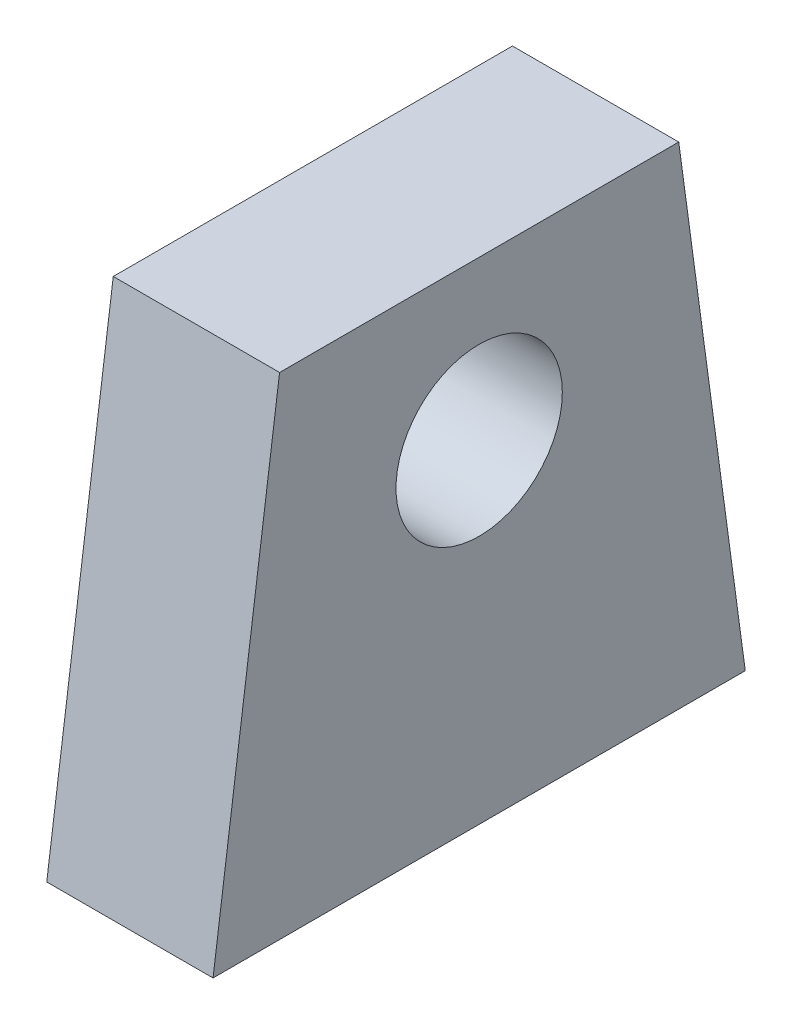
ISO-10303-21;
HEADER;
FILE_DESCRIPTION(('STEP AP214'),'2;1');
FILE_NAME('part.step','',(''),(''),'','','');
FILE_SCHEMA(('AUTOMOTIVE_DESIGN { 1 0 10303 214 1 1 1 1 }'));
ENDSEC;
DATA;
#1=APPLICATION_CONTEXT('core data for automotive mechanical design processes');
#2=APPLICATION_PROTOCOL_DEFINITION('international standard','automotive_design',2000,#1);
#3=PRODUCT_CONTEXT('',#1,'mechanical');
#4=PRODUCT('Part','Part','',(#3));
#5=PRODUCT_RELATED_PRODUCT_CATEGORY('part','',(#4));
#6=PRODUCT_DEFINITION_FORMATION('','',#4);
#7=PRODUCT_DEFINITION_CONTEXT('part definition',#1,'design');
#8=PRODUCT_DEFINITION('design','',#6,#7);
#9=PRODUCT_DEFINITION_SHAPE('','',#8);
#10=(LENGTH_UNIT() NAMED_UNIT(*) SI_UNIT(.MILLI.,.METRE.));
#11=(NAMED_UNIT(*) PLANE_ANGLE_UNIT() SI_UNIT($,.RADIAN.));
#12=(NAMED_UNIT(*) SI_UNIT($,.STERADIAN.) SOLID_ANGLE_UNIT());
#13=UNCERTAINTY_MEASURE_WITH_UNIT(LENGTH_MEASURE(1.E-05),#10,'distance_accuracy_value','');
#14=(GEOMETRIC_REPRESENTATION_CONTEXT(3) GLOBAL_UNCERTAINTY_ASSIGNED_CONTEXT((#13)) GLOBAL_UNIT_ASSIGNED_CONTEXT((#10,
#11,#12)) REPRESENTATION_CONTEXT('',''));
#15=CARTESIAN_POINT('',(0.,0.,0.));
#16=DIRECTION('',(0.,0.,1.));
#17=DIRECTION('',(1.,0.,0.));
#18=AXIS2_PLACEMENT_3D('',#15,#16,#17);
#19=CARTESIAN_POINT('',(5.,0.,0.));
#20=DIRECTION('',(-1.,0.,0.));
#21=DIRECTION('',(0.,0.,1.));
#22=AXIS2_PLACEMENT_3D('',#19,#20,#21);
#23=PLANE('',#22);
#24=DIRECTION('',(0.,0.990950558720919,-0.134227382343165));
#25=VECTOR('',#24,1.);
#26=CARTESIAN_POINT('',(5.,-10.,8.));
#27=LINE('',#26,#25);
#28=CARTESIAN_POINT('',(5.,-10.,8.));
#29=VERTEX_POINT('',#28);
#30=CARTESIAN_POINT('',(5.,4.76525193924236,6.));
#31=VERTEX_POINT('',#30);
#32=EDGE_CURVE('E107',#29,#31,#27,.T.);
#33=ORIENTED_EDGE('',*,*,#32,.F.);
#34=DIRECTION('',(0.,0.,1.));
#35=VECTOR('',#34,1.);
#36=CARTESIAN_POINT('',(5.,-10.,-8.));
#37=LINE('',#36,#35);
#38=CARTESIAN_POINT('',(5.,-10.,-8.));
#39=VERTEX_POINT('',#38);
#40=EDGE_CURVE('E100',#39,#29,#37,.T.);
#41=ORIENTED_EDGE('',*,*,#40,.F.);
#42=DIRECTION('',(0.,0.990950558720919,0.134227382343165));
#43=VECTOR('',#42,1.);
#44=CARTESIAN_POINT('',(5.,-10.,-8.));
#45=LINE('',#44,#43);
#46=CARTESIAN_POINT('',(5.,4.76525193924236,-6.));
#47=VERTEX_POINT('',#46);
#48=EDGE_CURVE('E96',#39,#47,#45,.T.);
#49=ORIENTED_EDGE('',*,*,#48,.T.);
#50=DIRECTION('',(0.,0.,-1.));
#51=VECTOR('',#50,1.);
#52=CARTESIAN_POINT('',(5.,4.76525193924236,6.));
#53=LINE('',#52,#51);
#54=EDGE_CURVE('E99',#31,#47,#53,.T.);
#55=ORIENTED_EDGE('',*,*,#54,.F.);
#56=EDGE_LOOP('',(#33,#41,#49,#55));
#57=FACE_BOUND('',#56,.T.);
#58=CARTESIAN_POINT('',(5.,0.,0.));
#59=DIRECTION('',(1.,0.,0.));
#60=DIRECTION('',(0.,0.,-1.));
#61=AXIS2_PLACEMENT_3D('',#58,#59,#60);
#62=CIRCLE('',#61,2.5);
#63=CARTESIAN_POINT('',(5.,0.,-2.5));
#64=VERTEX_POINT('',#63);
#65=EDGE_CURVE('E118',#64,#64,#62,.T.);
#66=ORIENTED_EDGE('',*,*,#65,.F.);
#67=EDGE_LOOP('',(#66));
#68=FACE_BOUND('',#67,.T.);
#69=ADVANCED_FACE('F48',(#57,#68),#23,.F.);
#70=CARTESIAN_POINT('',(0.,0.,0.));
#71=DIRECTION('',(-1.,0.,0.));
#72=DIRECTION('',(0.,0.,1.));
#73=AXIS2_PLACEMENT_3D('',#70,#71,#72);
#74=PLANE('',#73);
#75=DIRECTION('',(0.,0.990950558720919,-0.134227382343165));
#76=VECTOR('',#75,1.);
#77=CARTESIAN_POINT('',(0.,-10.,8.));
#78=LINE('',#77,#76);
#79=CARTESIAN_POINT('',(0.,-10.,8.));
#80=VERTEX_POINT('',#79);
#81=CARTESIAN_POINT('',(0.,4.76525193924236,6.));
#82=VERTEX_POINT('',#81);
#83=EDGE_CURVE('E114',#80,#82,#78,.T.);
#84=ORIENTED_EDGE('',*,*,#83,.T.);
#85=DIRECTION('',(0.,0.,-1.));
#86=VECTOR('',#85,1.);
#87=CARTESIAN_POINT('',(0.,4.76525193924236,6.));
#88=LINE('',#87,#86);
#89=CARTESIAN_POINT('',(0.,4.76525193924236,-6.));
#90=VERTEX_POINT('',#89);
#91=EDGE_CURVE('E117',#82,#90,#88,.T.);
#92=ORIENTED_EDGE('',*,*,#91,.T.);
#93=DIRECTION('',(0.,0.990950558720919,0.134227382343165));
#94=VECTOR('',#93,1.);
#95=CARTESIAN_POINT('',(0.,-10.,-8.));
#96=LINE('',#95,#94);
#97=CARTESIAN_POINT('',(0.,-10.,-8.));
#98=VERTEX_POINT('',#97);
#99=EDGE_CURVE('E104',#98,#90,#96,.T.);
#100=ORIENTED_EDGE('',*,*,#99,.F.);
#101=DIRECTION('',(0.,0.,1.));
#102=VECTOR('',#101,1.);
#103=CARTESIAN_POINT('',(0.,-10.,-8.));
#104=LINE('',#103,#102);
#105=EDGE_CURVE('E109',#98,#80,#104,.T.);
#106=ORIENTED_EDGE('',*,*,#105,.T.);
#107=EDGE_LOOP('',(#84,#92,#100,#106));
#108=FACE_BOUND('',#107,.T.);
#109=CARTESIAN_POINT('',(0.,0.,0.));
#110=DIRECTION('',(1.,0.,0.));
#111=DIRECTION('',(0.,0.,-1.));
#112=AXIS2_PLACEMENT_3D('',#109,#110,#111);
#113=CIRCLE('',#112,2.5);
#114=CARTESIAN_POINT('',(0.,0.,-2.5));
#115=VERTEX_POINT('',#114);
#116=EDGE_CURVE('E152',#115,#115,#113,.T.);
#117=ORIENTED_EDGE('',*,*,#116,.T.);
#118=EDGE_LOOP('',(#117));
#119=FACE_BOUND('',#118,.T.);
#120=ADVANCED_FACE('F124',(#108,#119),#74,.T.);
#121=CARTESIAN_POINT('',(5.,-10.,8.));
#122=DIRECTION('',(0.,0.134227382343165,0.990950558720919));
#123=DIRECTION('',(0.,-0.990950558720919,0.134227382343165));
#124=AXIS2_PLACEMENT_3D('',#121,#122,#123);
#125=PLANE('',#124);
#126=ORIENTED_EDGE('',*,*,#83,.F.);
#127=DIRECTION('',(-1.,0.,0.));
#128=VECTOR('',#127,1.);
#129=CARTESIAN_POINT('',(5.,-10.,8.));
#130=LINE('',#129,#128);
#131=EDGE_CURVE('E12',#29,#80,#130,.T.);
#132=ORIENTED_EDGE('',*,*,#131,.F.);
#133=ORIENTED_EDGE('',*,*,#32,.T.);
#134=DIRECTION('',(-1.,0.,0.));
#135=VECTOR('',#134,1.);
#136=CARTESIAN_POINT('',(5.,4.76525193924236,6.));
#137=LINE('',#136,#135);
#138=EDGE_CURVE('E52',#31,#82,#137,.T.);
#139=ORIENTED_EDGE('',*,*,#138,.T.);
#140=EDGE_LOOP('',(#126,#132,#133,#139));
#141=FACE_BOUND('',#140,.T.);
#142=ADVANCED_FACE('F50',(#141),#125,.T.);
#143=CARTESIAN_POINT('',(5.,-10.,-8.));
#144=DIRECTION('',(0.,-1.,0.));
#145=DIRECTION('',(0.,0.,-1.));
#146=AXIS2_PLACEMENT_3D('',#143,#144,#145);
#147=PLANE('',#146);
#148=ORIENTED_EDGE('',*,*,#105,.F.);
#149=DIRECTION('',(-1.,0.,0.));
#150=VECTOR('',#149,1.);
#151=CARTESIAN_POINT('',(5.,-10.,-8.));
#152=LINE('',#151,#150);
#153=EDGE_CURVE('E58',#39,#98,#152,.T.);
#154=ORIENTED_EDGE('',*,*,#153,.F.);
#155=ORIENTED_EDGE('',*,*,#40,.T.);
#156=ORIENTED_EDGE('',*,*,#131,.T.);
#157=EDGE_LOOP('',(#148,#154,#155,#156));
#158=FACE_BOUND('',#157,.T.);
#159=ADVANCED_FACE('F126',(#158),#147,.T.);
#160=CARTESIAN_POINT('',(5.,-10.,-8.));
#161=DIRECTION('',(0.,-0.134227382343165,0.990950558720919));
#162=DIRECTION('',(0.,-0.990950558720919,-0.134227382343165));
#163=AXIS2_PLACEMENT_3D('',#160,#161,#162);
#164=PLANE('',#163);
#165=ORIENTED_EDGE('',*,*,#99,.T.);
#166=DIRECTION('',(-1.,0.,0.));
#167=VECTOR('',#166,1.);
#168=CARTESIAN_POINT('',(5.,4.76525193924236,-6.));
#169=LINE('',#168,#167);
#170=EDGE_CURVE('E102',#47,#90,#169,.T.);
#171=ORIENTED_EDGE('',*,*,#170,.F.);
#172=ORIENTED_EDGE('',*,*,#48,.F.);
#173=ORIENTED_EDGE('',*,*,#153,.T.);
#174=EDGE_LOOP('',(#165,#171,#172,#173));
#175=FACE_BOUND('',#174,.T.);
#176=ADVANCED_FACE('F103',(#175),#164,.F.);
#177=CARTESIAN_POINT('',(5.,4.76525193924236,6.));
#178=DIRECTION('',(0.,1.,0.));
#179=DIRECTION('',(0.,0.,1.));
#180=AXIS2_PLACEMENT_3D('',#177,#178,#179);
#181=PLANE('',#180);
#182=ORIENTED_EDGE('',*,*,#91,.F.);
#183=ORIENTED_EDGE('',*,*,#138,.F.);
#184=ORIENTED_EDGE('',*,*,#54,.T.);
#185=ORIENTED_EDGE('',*,*,#170,.T.);
#186=EDGE_LOOP('',(#182,#183,#184,#185));
#187=FACE_BOUND('',#186,.T.);
#188=ADVANCED_FACE('F106',(#187),#181,.T.);
#189=CARTESIAN_POINT('',(5.,0.,0.));
#190=DIRECTION('',(-1.,0.,0.));
#191=DIRECTION('',(0.,0.,1.));
#192=AXIS2_PLACEMENT_3D('',#189,#190,#191);
#193=CYLINDRICAL_SURFACE('',#192,2.5);
#194=ORIENTED_EDGE('',*,*,#65,.T.);
#195=EDGE_LOOP('',(#194));
#196=FACE_BOUND('',#195,.T.);
#197=ORIENTED_EDGE('',*,*,#116,.F.);
#198=EDGE_LOOP('',(#197));
#199=FACE_BOUND('',#198,.T.);
#200=ADVANCED_FACE('F141',(#196,#199),#193,.F.);
#201=CLOSED_SHELL('',(#69,#120,#142,#159,#176,#188,#200));
#202=MANIFOLD_SOLID_BREP('B2',#201);
#203=ADVANCED_BREP_SHAPE_REPRESENTATION('',(#18,#202),#14);
#204=SHAPE_DEFINITION_REPRESENTATION(#9,#203);
ENDSEC;
END-ISO-10303-21;
